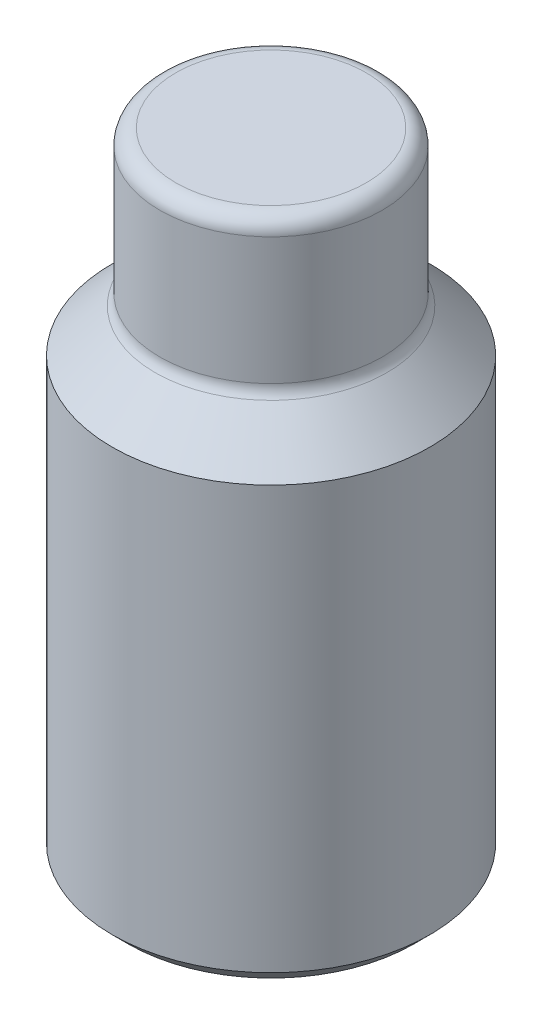
ISO-10303-21;
HEADER;
FILE_DESCRIPTION(('STEP AP214'),'2;1');
FILE_NAME('part.step','',(''),(''),'','','');
FILE_SCHEMA(('AUTOMOTIVE_DESIGN { 1 0 10303 214 1 1 1 1 }'));
ENDSEC;
DATA;
#1=APPLICATION_CONTEXT('core data for automotive mechanical design processes');
#2=APPLICATION_PROTOCOL_DEFINITION('international standard','automotive_design',2000,#1);
#3=PRODUCT_CONTEXT('',#1,'mechanical');
#4=PRODUCT('Part','Part','',(#3));
#5=PRODUCT_RELATED_PRODUCT_CATEGORY('part','',(#4));
#6=PRODUCT_DEFINITION_FORMATION('','',#4);
#7=PRODUCT_DEFINITION_CONTEXT('part definition',#1,'design');
#8=PRODUCT_DEFINITION('design','',#6,#7);
#9=PRODUCT_DEFINITION_SHAPE('','',#8);
#10=(LENGTH_UNIT() NAMED_UNIT(*) SI_UNIT(.MILLI.,.METRE.));
#11=(NAMED_UNIT(*) PLANE_ANGLE_UNIT() SI_UNIT($,.RADIAN.));
#12=(NAMED_UNIT(*) SI_UNIT($,.STERADIAN.) SOLID_ANGLE_UNIT());
#13=UNCERTAINTY_MEASURE_WITH_UNIT(LENGTH_MEASURE(1.E-05),#10,'distance_accuracy_value','');
#14=(GEOMETRIC_REPRESENTATION_CONTEXT(3) GLOBAL_UNCERTAINTY_ASSIGNED_CONTEXT((#13)) GLOBAL_UNIT_ASSIGNED_CONTEXT((#10,
#11,#12)) REPRESENTATION_CONTEXT('',''));
#15=CARTESIAN_POINT('',(0.,0.,0.));
#16=DIRECTION('',(0.,0.,1.));
#17=DIRECTION('',(1.,0.,0.));
#18=AXIS2_PLACEMENT_3D('',#15,#16,#17);
#19=CARTESIAN_POINT('',(0.,20.,0.));
#20=DIRECTION('',(0.,-1.,0.));
#21=DIRECTION('',(0.,0.,-1.));
#22=AXIS2_PLACEMENT_3D('',#19,#20,#21);
#23=CYLINDRICAL_SURFACE('',#22,3.5);
#24=CARTESIAN_POINT('',(0.,15.5,0.));
#25=DIRECTION('',(0.,1.,0.));
#26=DIRECTION('',(0.,0.,1.));
#27=AXIS2_PLACEMENT_3D('',#24,#25,#26);
#28=CIRCLE('',#27,3.5);
#29=CARTESIAN_POINT('',(0.,15.5,3.5));
#30=VERTEX_POINT('',#29);
#31=EDGE_CURVE('E193',#30,#30,#28,.T.);
#32=ORIENTED_EDGE('',*,*,#31,.T.);
#33=EDGE_LOOP('',(#32));
#34=FACE_BOUND('',#33,.T.);
#35=CARTESIAN_POINT('',(0.,19.5,0.));
#36=DIRECTION('',(0.,1.,0.));
#37=DIRECTION('',(0.,0.,1.));
#38=AXIS2_PLACEMENT_3D('',#35,#36,#37);
#39=CIRCLE('',#38,3.5);
#40=CARTESIAN_POINT('',(0.,19.5,3.5));
#41=VERTEX_POINT('',#40);
#42=EDGE_CURVE('E190',#41,#41,#39,.F.);
#43=ORIENTED_EDGE('',*,*,#42,.T.);
#44=EDGE_LOOP('',(#43));
#45=FACE_BOUND('',#44,.T.);
#46=ADVANCED_FACE('F38',(#34,#45),#23,.T.);
#47=CARTESIAN_POINT('',(0.,20.,0.));
#48=DIRECTION('',(0.,1.,0.));
#49=DIRECTION('',(0.,0.,1.));
#50=AXIS2_PLACEMENT_3D('',#47,#48,#49);
#51=PLANE('',#50);
#52=CARTESIAN_POINT('',(0.,20.,0.));
#53=DIRECTION('',(0.,1.,0.));
#54=DIRECTION('',(0.,0.,1.));
#55=AXIS2_PLACEMENT_3D('',#52,#53,#54);
#56=CIRCLE('',#55,3.);
#57=CARTESIAN_POINT('',(0.,20.,3.));
#58=VERTEX_POINT('',#57);
#59=EDGE_CURVE('E196',#58,#58,#56,.T.);
#60=ORIENTED_EDGE('',*,*,#59,.T.);
#61=EDGE_LOOP('',(#60));
#62=FACE_BOUND('',#61,.T.);
#63=ADVANCED_FACE('F215',(#62),#51,.T.);
#64=CARTESIAN_POINT('',(0.,15.5,0.));
#65=DIRECTION('',(0.,1.,0.));
#66=DIRECTION('',(0.,0.,1.));
#67=AXIS2_PLACEMENT_3D('',#64,#65,#66);
#68=TOROIDAL_SURFACE('',#67,4.,0.5);
#69=CARTESIAN_POINT('',(0.,15.1464466094067,0.));
#70=DIRECTION('',(0.,1.,0.));
#71=DIRECTION('',(0.,0.,1.));
#72=AXIS2_PLACEMENT_3D('',#69,#70,#71);
#73=CIRCLE('',#72,3.64644660940672);
#74=CARTESIAN_POINT('',(0.,15.1464466094067,3.64644660940672));
#75=VERTEX_POINT('',#74);
#76=EDGE_CURVE('E183',#75,#75,#73,.T.);
#77=ORIENTED_EDGE('',*,*,#76,.T.);
#78=EDGE_LOOP('',(#77));
#79=FACE_BOUND('',#78,.T.);
#80=ORIENTED_EDGE('',*,*,#31,.F.);
#81=EDGE_LOOP('',(#80));
#82=FACE_BOUND('',#81,.T.);
#83=ADVANCED_FACE('F221',(#79,#82),#68,.F.);
#84=CARTESIAN_POINT('',(0.,19.5,0.));
#85=DIRECTION('',(0.,1.,0.));
#86=DIRECTION('',(0.,0.,1.));
#87=AXIS2_PLACEMENT_3D('',#84,#85,#86);
#88=TOROIDAL_SURFACE('',#87,3.,0.5);
#89=ORIENTED_EDGE('',*,*,#42,.F.);
#90=EDGE_LOOP('',(#89));
#91=FACE_BOUND('',#90,.T.);
#92=ORIENTED_EDGE('',*,*,#59,.F.);
#93=EDGE_LOOP('',(#92));
#94=FACE_BOUND('',#93,.T.);
#95=ADVANCED_FACE('F235',(#91,#94),#88,.T.);
#96=CARTESIAN_POINT('',(0.,13.7928932188134,0.));
#97=DIRECTION('',(0.,-1.,0.));
#98=DIRECTION('',(0.,0.,-1.));
#99=AXIS2_PLACEMENT_3D('',#96,#97,#98);
#100=CONICAL_SURFACE('',#99,5.,0.785398163397443);
#101=ORIENTED_EDGE('',*,*,#76,.F.);
#102=EDGE_LOOP('',(#101));
#103=FACE_BOUND('',#102,.T.);
#104=CARTESIAN_POINT('',(0.,13.7928932188134,0.));
#105=DIRECTION('',(0.,1.,0.));
#106=DIRECTION('',(0.,0.,1.));
#107=AXIS2_PLACEMENT_3D('',#104,#105,#106);
#108=CIRCLE('',#107,5.);
#109=CARTESIAN_POINT('',(0.,13.7928932188134,5.));
#110=VERTEX_POINT('',#109);
#111=EDGE_CURVE('E187',#110,#110,#108,.T.);
#112=ORIENTED_EDGE('',*,*,#111,.T.);
#113=EDGE_LOOP('',(#112));
#114=FACE_BOUND('',#113,.T.);
#115=ADVANCED_FACE('F230',(#103,#114),#100,.T.);
#116=CARTESIAN_POINT('',(0.,0.,0.));
#117=DIRECTION('',(0.,1.,0.));
#118=DIRECTION('',(0.,0.,1.));
#119=AXIS2_PLACEMENT_3D('',#116,#117,#118);
#120=PLANE('',#119);
#121=CARTESIAN_POINT('',(0.,0.,0.));
#122=DIRECTION('',(0.,1.,0.));
#123=DIRECTION('',(0.,0.,1.));
#124=AXIS2_PLACEMENT_3D('',#121,#122,#123);
#125=CIRCLE('',#124,4.5);
#126=CARTESIAN_POINT('',(0.,0.,4.5));
#127=VERTEX_POINT('',#126);
#128=EDGE_CURVE('E11',#127,#127,#125,.F.);
#129=ORIENTED_EDGE('',*,*,#128,.T.);
#130=EDGE_LOOP('',(#129));
#131=FACE_BOUND('',#130,.T.);
#132=DIRECTION('',(-0.5,0.,-0.866025403784439));
#133=VECTOR('',#132,1.);
#134=CARTESIAN_POINT('',(-1.44337567297406,0.,2.5));
#135=LINE('',#134,#133);
#136=CARTESIAN_POINT('',(-1.44337567297406,0.,2.5));
#137=VERTEX_POINT('',#136);
#138=CARTESIAN_POINT('',(-2.88675134594813,0.,0.));
#139=VERTEX_POINT('',#138);
#140=EDGE_CURVE('E54',#137,#139,#135,.T.);
#141=ORIENTED_EDGE('',*,*,#140,.F.);
#142=DIRECTION('',(-1.,0.,0.));
#143=VECTOR('',#142,1.);
#144=CARTESIAN_POINT('',(1.44337567297406,0.,2.5));
#145=LINE('',#144,#143);
#146=CARTESIAN_POINT('',(1.44337567297406,0.,2.5));
#147=VERTEX_POINT('',#146);
#148=EDGE_CURVE('E130',#147,#137,#145,.T.);
#149=ORIENTED_EDGE('',*,*,#148,.F.);
#150=DIRECTION('',(-0.5,0.,0.866025403784438));
#151=VECTOR('',#150,1.);
#152=CARTESIAN_POINT('',(2.88675134594813,0.,0.));
#153=LINE('',#152,#151);
#154=CARTESIAN_POINT('',(2.88675134594813,0.,0.));
#155=VERTEX_POINT('',#154);
#156=EDGE_CURVE('E124',#155,#147,#153,.T.);
#157=ORIENTED_EDGE('',*,*,#156,.F.);
#158=DIRECTION('',(0.5,0.,0.866025403784439));
#159=VECTOR('',#158,1.);
#160=CARTESIAN_POINT('',(1.44337567297406,0.,-2.5));
#161=LINE('',#160,#159);
#162=CARTESIAN_POINT('',(1.44337567297406,0.,-2.5));
#163=VERTEX_POINT('',#162);
#164=EDGE_CURVE('E161',#163,#155,#161,.T.);
#165=ORIENTED_EDGE('',*,*,#164,.F.);
#166=DIRECTION('',(1.,0.,0.));
#167=VECTOR('',#166,1.);
#168=CARTESIAN_POINT('',(-1.44337567297406,0.,-2.5));
#169=LINE('',#168,#167);
#170=CARTESIAN_POINT('',(-1.44337567297406,0.,-2.5));
#171=VERTEX_POINT('',#170);
#172=EDGE_CURVE('E158',#171,#163,#169,.T.);
#173=ORIENTED_EDGE('',*,*,#172,.F.);
#174=DIRECTION('',(0.5,0.,-0.866025403784438));
#175=VECTOR('',#174,1.);
#176=CARTESIAN_POINT('',(-2.88675134594813,0.,0.));
#177=LINE('',#176,#175);
#178=EDGE_CURVE('E156',#139,#171,#177,.T.);
#179=ORIENTED_EDGE('',*,*,#178,.F.);
#180=EDGE_LOOP('',(#141,#149,#157,#165,#173,#179));
#181=FACE_BOUND('',#180,.T.);
#182=ADVANCED_FACE('F227',(#131,#181),#120,.F.);
#183=CARTESIAN_POINT('',(0.,15.,0.));
#184=DIRECTION('',(0.,-1.,0.));
#185=DIRECTION('',(0.,0.,-1.));
#186=AXIS2_PLACEMENT_3D('',#183,#184,#185);
#187=CYLINDRICAL_SURFACE('',#186,5.);
#188=CARTESIAN_POINT('',(0.,0.499999999999997,0.));
#189=DIRECTION('',(0.,1.,0.));
#190=DIRECTION('',(0.,0.,1.));
#191=AXIS2_PLACEMENT_3D('',#188,#189,#190);
#192=CIRCLE('',#191,5.);
#193=CARTESIAN_POINT('',(0.,0.499999999999997,5.));
#194=VERTEX_POINT('',#193);
#195=EDGE_CURVE('E47',#194,#194,#192,.T.);
#196=ORIENTED_EDGE('',*,*,#195,.T.);
#197=EDGE_LOOP('',(#196));
#198=FACE_BOUND('',#197,.T.);
#199=ORIENTED_EDGE('',*,*,#111,.F.);
#200=EDGE_LOOP('',(#199));
#201=FACE_BOUND('',#200,.T.);
#202=ADVANCED_FACE('F201',(#198,#201),#187,.T.);
#203=CARTESIAN_POINT('',(1.44337567297406,6.,2.5));
#204=DIRECTION('',(0.,0.,1.));
#205=DIRECTION('',(1.,0.,0.));
#206=AXIS2_PLACEMENT_3D('',#203,#204,#205);
#207=PLANE('',#206);
#208=ORIENTED_EDGE('',*,*,#148,.T.);
#209=DIRECTION('',(0.,-1.,0.));
#210=VECTOR('',#209,1.);
#211=CARTESIAN_POINT('',(-1.44337567297406,6.,2.5));
#212=LINE('',#211,#210);
#213=CARTESIAN_POINT('',(-1.44337567297406,6.,2.5));
#214=VERTEX_POINT('',#213);
#215=EDGE_CURVE('E127',#214,#137,#212,.T.);
#216=ORIENTED_EDGE('',*,*,#215,.F.);
#217=DIRECTION('',(-1.,0.,0.));
#218=VECTOR('',#217,1.);
#219=CARTESIAN_POINT('',(1.44337567297406,6.,2.5));
#220=LINE('',#219,#218);
#221=CARTESIAN_POINT('',(0.,6.,2.5));
#222=VERTEX_POINT('',#221);
#223=EDGE_CURVE('E113',#222,#214,#220,.T.);
#224=ORIENTED_EDGE('',*,*,#223,.F.);
#225=CARTESIAN_POINT('',(1.44337567297406,6.,2.5));
#226=VERTEX_POINT('',#225);
#227=EDGE_CURVE('E123',#226,#222,#220,.T.);
#228=ORIENTED_EDGE('',*,*,#227,.F.);
#229=DIRECTION('',(0.,-1.,0.));
#230=VECTOR('',#229,1.);
#231=CARTESIAN_POINT('',(1.44337567297406,6.,2.5));
#232=LINE('',#231,#230);
#233=EDGE_CURVE('E166',#226,#147,#232,.T.);
#234=ORIENTED_EDGE('',*,*,#233,.T.);
#235=EDGE_LOOP('',(#208,#216,#224,#228,#234));
#236=FACE_BOUND('',#235,.T.);
#237=ADVANCED_FACE('F128',(#236),#207,.F.);
#238=CARTESIAN_POINT('',(2.88675134594813,6.,0.));
#239=DIRECTION('',(0.866025403784438,0.,0.5));
#240=DIRECTION('',(0.5,0.,-0.866025403784439));
#241=AXIS2_PLACEMENT_3D('',#238,#239,#240);
#242=PLANE('',#241);
#243=ORIENTED_EDGE('',*,*,#156,.T.);
#244=ORIENTED_EDGE('',*,*,#233,.F.);
#245=DIRECTION('',(-0.5,0.,0.866025403784438));
#246=VECTOR('',#245,1.);
#247=CARTESIAN_POINT('',(2.88675134594813,6.,0.));
#248=LINE('',#247,#246);
#249=CARTESIAN_POINT('',(2.1650635094611,6.,1.25));
#250=VERTEX_POINT('',#249);
#251=EDGE_CURVE('E151',#250,#226,#248,.T.);
#252=ORIENTED_EDGE('',*,*,#251,.F.);
#253=CARTESIAN_POINT('',(2.88675134594813,6.,0.));
#254=VERTEX_POINT('',#253);
#255=EDGE_CURVE('E133',#254,#250,#248,.T.);
#256=ORIENTED_EDGE('',*,*,#255,.F.);
#257=DIRECTION('',(0.,-1.,0.));
#258=VECTOR('',#257,1.);
#259=CARTESIAN_POINT('',(2.88675134594813,6.,0.));
#260=LINE('',#259,#258);
#261=EDGE_CURVE('E169',#254,#155,#260,.T.);
#262=ORIENTED_EDGE('',*,*,#261,.T.);
#263=EDGE_LOOP('',(#243,#244,#252,#256,#262));
#264=FACE_BOUND('',#263,.T.);
#265=ADVANCED_FACE('F253',(#264),#242,.F.);
#266=CARTESIAN_POINT('',(1.44337567297406,6.,-2.5));
#267=DIRECTION('',(0.866025403784439,0.,-0.5));
#268=DIRECTION('',(-0.5,0.,-0.866025403784439));
#269=AXIS2_PLACEMENT_3D('',#266,#267,#268);
#270=PLANE('',#269);
#271=ORIENTED_EDGE('',*,*,#164,.T.);
#272=ORIENTED_EDGE('',*,*,#261,.F.);
#273=DIRECTION('',(0.5,0.,0.866025403784439));
#274=VECTOR('',#273,1.);
#275=CARTESIAN_POINT('',(1.44337567297406,6.,-2.5));
#276=LINE('',#275,#274);
#277=CARTESIAN_POINT('',(2.1650635094611,6.,-1.25));
#278=VERTEX_POINT('',#277);
#279=EDGE_CURVE('E149',#278,#254,#276,.T.);
#280=ORIENTED_EDGE('',*,*,#279,.F.);
#281=CARTESIAN_POINT('',(1.44337567297406,6.,-2.5));
#282=VERTEX_POINT('',#281);
#283=EDGE_CURVE('E62',#282,#278,#276,.T.);
#284=ORIENTED_EDGE('',*,*,#283,.F.);
#285=DIRECTION('',(0.,-1.,0.));
#286=VECTOR('',#285,1.);
#287=CARTESIAN_POINT('',(1.44337567297406,6.,-2.5));
#288=LINE('',#287,#286);
#289=EDGE_CURVE('E172',#282,#163,#288,.T.);
#290=ORIENTED_EDGE('',*,*,#289,.T.);
#291=EDGE_LOOP('',(#271,#272,#280,#284,#290));
#292=FACE_BOUND('',#291,.T.);
#293=ADVANCED_FACE('F264',(#292),#270,.F.);
#294=CARTESIAN_POINT('',(-1.44337567297406,6.,-2.5));
#295=DIRECTION('',(0.,0.,-1.));
#296=DIRECTION('',(-1.,0.,0.));
#297=AXIS2_PLACEMENT_3D('',#294,#295,#296);
#298=PLANE('',#297);
#299=ORIENTED_EDGE('',*,*,#172,.T.);
#300=ORIENTED_EDGE('',*,*,#289,.F.);
#301=DIRECTION('',(1.,0.,0.));
#302=VECTOR('',#301,1.);
#303=CARTESIAN_POINT('',(-1.44337567297406,6.,-2.5));
#304=LINE('',#303,#302);
#305=CARTESIAN_POINT('',(0.,6.,-2.5));
#306=VERTEX_POINT('',#305);
#307=EDGE_CURVE('E145',#306,#282,#304,.T.);
#308=ORIENTED_EDGE('',*,*,#307,.F.);
#309=CARTESIAN_POINT('',(-1.44337567297406,6.,-2.5));
#310=VERTEX_POINT('',#309);
#311=EDGE_CURVE('E146',#310,#306,#304,.T.);
#312=ORIENTED_EDGE('',*,*,#311,.F.);
#313=DIRECTION('',(0.,-1.,0.));
#314=VECTOR('',#313,1.);
#315=CARTESIAN_POINT('',(-1.44337567297406,6.,-2.5));
#316=LINE('',#315,#314);
#317=EDGE_CURVE('E175',#310,#171,#316,.T.);
#318=ORIENTED_EDGE('',*,*,#317,.T.);
#319=EDGE_LOOP('',(#299,#300,#308,#312,#318));
#320=FACE_BOUND('',#319,.T.);
#321=ADVANCED_FACE('F260',(#320),#298,.F.);
#322=CARTESIAN_POINT('',(-2.88675134594813,6.,0.));
#323=DIRECTION('',(-0.866025403784438,0.,-0.5));
#324=DIRECTION('',(-0.5,0.,0.866025403784438));
#325=AXIS2_PLACEMENT_3D('',#322,#323,#324);
#326=PLANE('',#325);
#327=ORIENTED_EDGE('',*,*,#178,.T.);
#328=ORIENTED_EDGE('',*,*,#317,.F.);
#329=DIRECTION('',(0.5,0.,-0.866025403784438));
#330=VECTOR('',#329,1.);
#331=CARTESIAN_POINT('',(-2.88675134594813,6.,0.));
#332=LINE('',#331,#330);
#333=CARTESIAN_POINT('',(-2.1650635094611,6.,-1.25));
#334=VERTEX_POINT('',#333);
#335=EDGE_CURVE('E139',#334,#310,#332,.T.);
#336=ORIENTED_EDGE('',*,*,#335,.F.);
#337=CARTESIAN_POINT('',(-2.88675134594813,6.,0.));
#338=VERTEX_POINT('',#337);
#339=EDGE_CURVE('E141',#338,#334,#332,.T.);
#340=ORIENTED_EDGE('',*,*,#339,.F.);
#341=DIRECTION('',(0.,-1.,0.));
#342=VECTOR('',#341,1.);
#343=CARTESIAN_POINT('',(-2.88675134594813,6.,0.));
#344=LINE('',#343,#342);
#345=EDGE_CURVE('E132',#338,#139,#344,.T.);
#346=ORIENTED_EDGE('',*,*,#345,.T.);
#347=EDGE_LOOP('',(#327,#328,#336,#340,#346));
#348=FACE_BOUND('',#347,.T.);
#349=ADVANCED_FACE('F257',(#348),#326,.F.);
#350=CARTESIAN_POINT('',(-1.44337567297406,6.,2.5));
#351=DIRECTION('',(-0.866025403784438,0.,0.5));
#352=DIRECTION('',(0.5,0.,0.866025403784439));
#353=AXIS2_PLACEMENT_3D('',#350,#351,#352);
#354=PLANE('',#353);
#355=ORIENTED_EDGE('',*,*,#140,.T.);
#356=ORIENTED_EDGE('',*,*,#345,.F.);
#357=DIRECTION('',(-0.5,0.,-0.866025403784439));
#358=VECTOR('',#357,1.);
#359=CARTESIAN_POINT('',(-1.44337567297406,6.,2.5));
#360=LINE('',#359,#358);
#361=CARTESIAN_POINT('',(-2.1650635094611,6.,1.25));
#362=VERTEX_POINT('',#361);
#363=EDGE_CURVE('E138',#362,#338,#360,.T.);
#364=ORIENTED_EDGE('',*,*,#363,.F.);
#365=EDGE_CURVE('E117',#214,#362,#360,.T.);
#366=ORIENTED_EDGE('',*,*,#365,.F.);
#367=ORIENTED_EDGE('',*,*,#215,.T.);
#368=EDGE_LOOP('',(#355,#356,#364,#366,#367));
#369=FACE_BOUND('',#368,.T.);
#370=ADVANCED_FACE('F136',(#369),#354,.F.);
#371=CARTESIAN_POINT('',(0.,6.,0.));
#372=DIRECTION('',(0.,-1.,0.));
#373=DIRECTION('',(0.,0.,-1.));
#374=AXIS2_PLACEMENT_3D('',#371,#372,#373);
#375=PLANE('',#374);
#376=CARTESIAN_POINT('',(0.,6.,0.));
#377=DIRECTION('',(0.,-1.,0.));
#378=DIRECTION('',(0.,0.,-1.));
#379=AXIS2_PLACEMENT_3D('',#376,#377,#378);
#380=CIRCLE('',#379,2.5);
#381=EDGE_CURVE('E168',#334,#306,#380,.T.);
#382=ORIENTED_EDGE('',*,*,#381,.F.);
#383=ORIENTED_EDGE('',*,*,#335,.T.);
#384=ORIENTED_EDGE('',*,*,#311,.T.);
#385=EDGE_LOOP('',(#382,#383,#384));
#386=FACE_BOUND('',#385,.T.);
#387=ADVANCED_FACE('F256',(#386),#375,.T.);
#388=EDGE_CURVE('E295',#362,#334,#380,.T.);
#389=ORIENTED_EDGE('',*,*,#388,.F.);
#390=ORIENTED_EDGE('',*,*,#363,.T.);
#391=ORIENTED_EDGE('',*,*,#339,.T.);
#392=EDGE_LOOP('',(#389,#390,#391));
#393=FACE_BOUND('',#392,.T.);
#394=ADVANCED_FACE('F273',(#393),#375,.T.);
#395=EDGE_CURVE('E119',#222,#362,#380,.T.);
#396=ORIENTED_EDGE('',*,*,#395,.F.);
#397=ORIENTED_EDGE('',*,*,#223,.T.);
#398=ORIENTED_EDGE('',*,*,#365,.T.);
#399=EDGE_LOOP('',(#396,#397,#398));
#400=FACE_BOUND('',#399,.T.);
#401=ADVANCED_FACE('F115',(#400),#375,.T.);
#402=EDGE_CURVE('E296',#250,#222,#380,.T.);
#403=ORIENTED_EDGE('',*,*,#402,.F.);
#404=ORIENTED_EDGE('',*,*,#251,.T.);
#405=ORIENTED_EDGE('',*,*,#227,.T.);
#406=EDGE_LOOP('',(#403,#404,#405));
#407=FACE_BOUND('',#406,.T.);
#408=ADVANCED_FACE('F284',(#407),#375,.T.);
#409=EDGE_CURVE('E184',#278,#250,#380,.T.);
#410=ORIENTED_EDGE('',*,*,#409,.F.);
#411=ORIENTED_EDGE('',*,*,#279,.T.);
#412=ORIENTED_EDGE('',*,*,#255,.T.);
#413=EDGE_LOOP('',(#410,#411,#412));
#414=FACE_BOUND('',#413,.T.);
#415=ADVANCED_FACE('F280',(#414),#375,.T.);
#416=EDGE_CURVE('E180',#306,#278,#380,.T.);
#417=ORIENTED_EDGE('',*,*,#416,.F.);
#418=ORIENTED_EDGE('',*,*,#307,.T.);
#419=ORIENTED_EDGE('',*,*,#283,.T.);
#420=EDGE_LOOP('',(#417,#418,#419));
#421=FACE_BOUND('',#420,.T.);
#422=ADVANCED_FACE('F210',(#421),#375,.T.);
#423=CARTESIAN_POINT('',(0.,6.,0.));
#424=DIRECTION('',(0.,-1.,0.));
#425=DIRECTION('',(0.,0.,-1.));
#426=AXIS2_PLACEMENT_3D('',#423,#424,#425);
#427=CONICAL_SURFACE('',#426,2.5,1.02974425867665);
#428=CARTESIAN_POINT('',(0.,7.5021515475689,0.));
#429=VERTEX_POINT('',#428);
#430=VERTEX_LOOP('',#429);
#431=FACE_BOUND('',#430,.T.);
#432=ORIENTED_EDGE('',*,*,#416,.T.);
#433=ORIENTED_EDGE('',*,*,#409,.T.);
#434=ORIENTED_EDGE('',*,*,#402,.T.);
#435=ORIENTED_EDGE('',*,*,#395,.T.);
#436=ORIENTED_EDGE('',*,*,#388,.T.);
#437=ORIENTED_EDGE('',*,*,#381,.T.);
#438=EDGE_LOOP('',(#432,#433,#434,#435,#436,#437));
#439=FACE_BOUND('',#438,.T.);
#440=ADVANCED_FACE('F205',(#431,#439),#427,.F.);
#441=CARTESIAN_POINT('',(0.,0.499999999999997,0.));
#442=DIRECTION('',(0.,1.,0.));
#443=DIRECTION('',(0.,0.,1.));
#444=AXIS2_PLACEMENT_3D('',#441,#442,#443);
#445=CONICAL_SURFACE('',#444,5.,0.785398163397452);
#446=ORIENTED_EDGE('',*,*,#128,.F.);
#447=EDGE_LOOP('',(#446));
#448=FACE_BOUND('',#447,.T.);
#449=ORIENTED_EDGE('',*,*,#195,.F.);
#450=EDGE_LOOP('',(#449));
#451=FACE_BOUND('',#450,.T.);
#452=ADVANCED_FACE('F41',(#448,#451),#445,.T.);
#453=CLOSED_SHELL('',(#46,#63,#83,#95,#115,#182,#202,#237,#265,#293,#321,#349,#370,#387,#394,
#401,#408,#415,#422,#440,#452));
#454=MANIFOLD_SOLID_BREP('B2',#453);
#455=ADVANCED_BREP_SHAPE_REPRESENTATION('',(#18,#454),#14);
#456=SHAPE_DEFINITION_REPRESENTATION(#9,#455);
ENDSEC;
END-ISO-10303-21;
